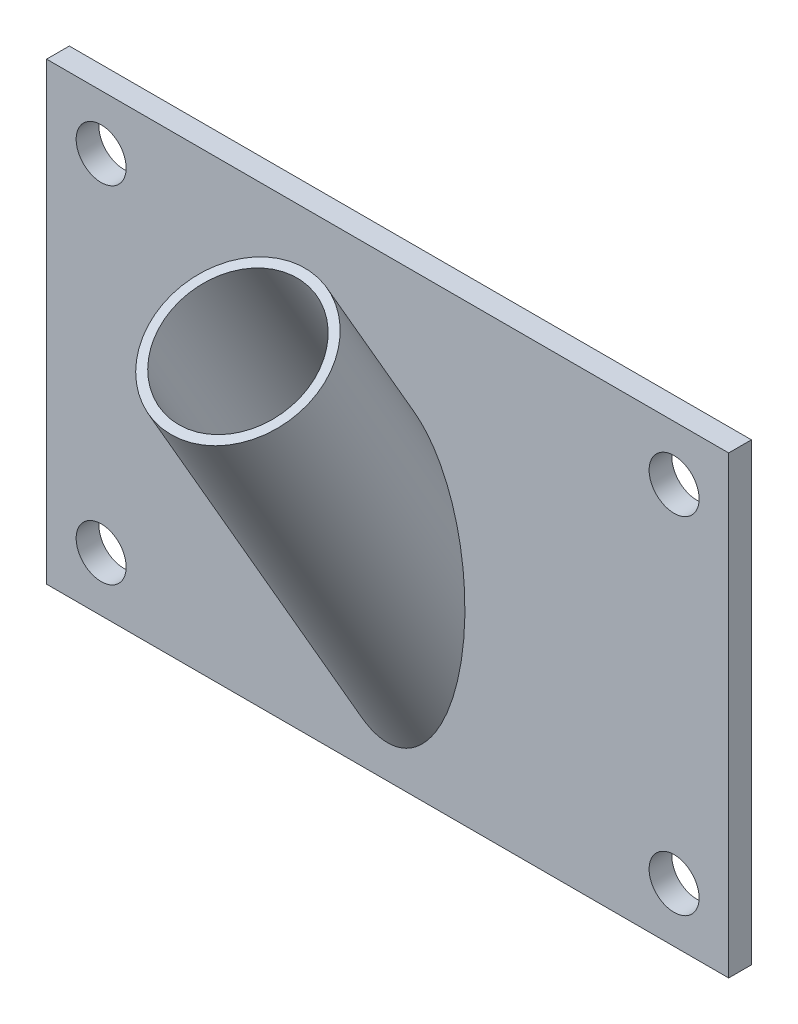
ISO-10303-21;
HEADER;
FILE_DESCRIPTION(('STEP AP214'),'2;1');
FILE_NAME('part.step','',(''),(''),'','','');
FILE_SCHEMA(('AUTOMOTIVE_DESIGN { 1 0 10303 214 1 1 1 1 }'));
ENDSEC;
DATA;
#1=APPLICATION_CONTEXT('core data for automotive mechanical design processes');
#2=APPLICATION_PROTOCOL_DEFINITION('international standard','automotive_design',2000,#1);
#3=PRODUCT_CONTEXT('',#1,'mechanical');
#4=PRODUCT('Part','Part','',(#3));
#5=PRODUCT_RELATED_PRODUCT_CATEGORY('part','',(#4));
#6=PRODUCT_DEFINITION_FORMATION('','',#4);
#7=PRODUCT_DEFINITION_CONTEXT('part definition',#1,'design');
#8=PRODUCT_DEFINITION('design','',#6,#7);
#9=PRODUCT_DEFINITION_SHAPE('','',#8);
#10=(LENGTH_UNIT() NAMED_UNIT(*) SI_UNIT(.MILLI.,.METRE.));
#11=(NAMED_UNIT(*) PLANE_ANGLE_UNIT() SI_UNIT($,.RADIAN.));
#12=(NAMED_UNIT(*) SI_UNIT($,.STERADIAN.) SOLID_ANGLE_UNIT());
#13=UNCERTAINTY_MEASURE_WITH_UNIT(LENGTH_MEASURE(1.E-05),#10,'distance_accuracy_value','');
#14=(GEOMETRIC_REPRESENTATION_CONTEXT(3) GLOBAL_UNCERTAINTY_ASSIGNED_CONTEXT((#13)) GLOBAL_UNIT_ASSIGNED_CONTEXT((#10,
#11,#12)) REPRESENTATION_CONTEXT('',''));
#15=CARTESIAN_POINT('',(0.,0.,0.));
#16=DIRECTION('',(0.,0.,1.));
#17=DIRECTION('',(1.,0.,0.));
#18=AXIS2_PLACEMENT_3D('',#15,#16,#17);
#19=CARTESIAN_POINT('',(-75.,49.9999999999999,5.));
#20=DIRECTION('',(1.,0.,0.));
#21=DIRECTION('',(0.,0.,-1.));
#22=AXIS2_PLACEMENT_3D('',#19,#20,#21);
#23=PLANE('',#22);
#24=DIRECTION('',(0.,-1.,0.));
#25=VECTOR('',#24,1.);
#26=CARTESIAN_POINT('',(-75.,49.9999999999999,0.));
#27=LINE('',#26,#25);
#28=CARTESIAN_POINT('',(-75.,49.9999999999999,0.));
#29=VERTEX_POINT('',#28);
#30=CARTESIAN_POINT('',(-75.,-50.0000000000001,0.));
#31=VERTEX_POINT('',#30);
#32=EDGE_CURVE('E109',#29,#31,#27,.T.);
#33=ORIENTED_EDGE('',*,*,#32,.T.);
#34=DIRECTION('',(0.,0.,-1.));
#35=VECTOR('',#34,1.);
#36=CARTESIAN_POINT('',(-75.,-50.0000000000001,5.));
#37=LINE('',#36,#35);
#38=CARTESIAN_POINT('',(-75.,-50.0000000000001,5.));
#39=VERTEX_POINT('',#38);
#40=EDGE_CURVE('E47',#39,#31,#37,.T.);
#41=ORIENTED_EDGE('',*,*,#40,.F.);
#42=DIRECTION('',(0.,-1.,0.));
#43=VECTOR('',#42,1.);
#44=CARTESIAN_POINT('',(-75.,49.9999999999999,5.));
#45=LINE('',#44,#43);
#46=CARTESIAN_POINT('',(-75.,49.9999999999999,5.));
#47=VERTEX_POINT('',#46);
#48=EDGE_CURVE('E91',#47,#39,#45,.T.);
#49=ORIENTED_EDGE('',*,*,#48,.F.);
#50=DIRECTION('',(0.,0.,-1.));
#51=VECTOR('',#50,1.);
#52=CARTESIAN_POINT('',(-75.,49.9999999999999,5.));
#53=LINE('',#52,#51);
#54=EDGE_CURVE('E105',#47,#29,#53,.T.);
#55=ORIENTED_EDGE('',*,*,#54,.T.);
#56=EDGE_LOOP('',(#33,#41,#49,#55));
#57=FACE_BOUND('',#56,.T.);
#58=ADVANCED_FACE('F38',(#57),#23,.F.);
#59=CARTESIAN_POINT('',(-75.,-50.0000000000001,5.));
#60=DIRECTION('',(0.,1.,0.));
#61=DIRECTION('',(0.,0.,1.));
#62=AXIS2_PLACEMENT_3D('',#59,#60,#61);
#63=PLANE('',#62);
#64=DIRECTION('',(1.,0.,0.));
#65=VECTOR('',#64,1.);
#66=CARTESIAN_POINT('',(-75.,-50.0000000000001,0.));
#67=LINE('',#66,#65);
#68=CARTESIAN_POINT('',(75.,-50.0000000000001,0.));
#69=VERTEX_POINT('',#68);
#70=EDGE_CURVE('E97',#31,#69,#67,.T.);
#71=ORIENTED_EDGE('',*,*,#70,.T.);
#72=DIRECTION('',(0.,0.,-1.));
#73=VECTOR('',#72,1.);
#74=CARTESIAN_POINT('',(75.,-50.0000000000001,5.));
#75=LINE('',#74,#73);
#76=CARTESIAN_POINT('',(75.,-50.0000000000001,5.));
#77=VERTEX_POINT('',#76);
#78=EDGE_CURVE('E95',#77,#69,#75,.T.);
#79=ORIENTED_EDGE('',*,*,#78,.F.);
#80=DIRECTION('',(1.,0.,0.));
#81=VECTOR('',#80,1.);
#82=CARTESIAN_POINT('',(-75.,-50.0000000000001,5.));
#83=LINE('',#82,#81);
#84=EDGE_CURVE('E86',#39,#77,#83,.T.);
#85=ORIENTED_EDGE('',*,*,#84,.F.);
#86=ORIENTED_EDGE('',*,*,#40,.T.);
#87=EDGE_LOOP('',(#71,#79,#85,#86));
#88=FACE_BOUND('',#87,.T.);
#89=ADVANCED_FACE('F96',(#88),#63,.F.);
#90=CARTESIAN_POINT('',(75.,49.9999999999999,5.));
#91=DIRECTION('',(-1.,0.,0.));
#92=DIRECTION('',(0.,0.,1.));
#93=AXIS2_PLACEMENT_3D('',#90,#91,#92);
#94=PLANE('',#93);
#95=DIRECTION('',(0.,1.,0.));
#96=VECTOR('',#95,1.);
#97=CARTESIAN_POINT('',(75.,49.9999999999999,0.));
#98=LINE('',#97,#96);
#99=CARTESIAN_POINT('',(75.,49.9999999999999,0.));
#100=VERTEX_POINT('',#99);
#101=EDGE_CURVE('E72',#69,#100,#98,.T.);
#102=ORIENTED_EDGE('',*,*,#101,.T.);
#103=DIRECTION('',(0.,0.,-1.));
#104=VECTOR('',#103,1.);
#105=CARTESIAN_POINT('',(75.,49.9999999999999,5.));
#106=LINE('',#105,#104);
#107=CARTESIAN_POINT('',(75.,49.9999999999999,5.));
#108=VERTEX_POINT('',#107);
#109=EDGE_CURVE('E99',#108,#100,#106,.T.);
#110=ORIENTED_EDGE('',*,*,#109,.F.);
#111=DIRECTION('',(0.,1.,0.));
#112=VECTOR('',#111,1.);
#113=CARTESIAN_POINT('',(75.,49.9999999999999,5.));
#114=LINE('',#113,#112);
#115=EDGE_CURVE('E89',#77,#108,#114,.T.);
#116=ORIENTED_EDGE('',*,*,#115,.F.);
#117=ORIENTED_EDGE('',*,*,#78,.T.);
#118=EDGE_LOOP('',(#102,#110,#116,#117));
#119=FACE_BOUND('',#118,.T.);
#120=ADVANCED_FACE('F101',(#119),#94,.F.);
#121=CARTESIAN_POINT('',(-75.,49.9999999999999,5.));
#122=DIRECTION('',(0.,-1.,0.));
#123=DIRECTION('',(0.,0.,-1.));
#124=AXIS2_PLACEMENT_3D('',#121,#122,#123);
#125=PLANE('',#124);
#126=DIRECTION('',(-1.,0.,0.));
#127=VECTOR('',#126,1.);
#128=CARTESIAN_POINT('',(-75.,49.9999999999999,0.));
#129=LINE('',#128,#127);
#130=EDGE_CURVE('E78',#100,#29,#129,.T.);
#131=ORIENTED_EDGE('',*,*,#130,.T.);
#132=ORIENTED_EDGE('',*,*,#54,.F.);
#133=DIRECTION('',(-1.,0.,0.));
#134=VECTOR('',#133,1.);
#135=CARTESIAN_POINT('',(-75.,49.9999999999999,5.));
#136=LINE('',#135,#134);
#137=EDGE_CURVE('E55',#108,#47,#136,.T.);
#138=ORIENTED_EDGE('',*,*,#137,.F.);
#139=ORIENTED_EDGE('',*,*,#109,.T.);
#140=EDGE_LOOP('',(#131,#132,#138,#139));
#141=FACE_BOUND('',#140,.T.);
#142=ADVANCED_FACE('F139',(#141),#125,.F.);
#143=CARTESIAN_POINT('',(0.,0.,5.));
#144=DIRECTION('',(0.,0.,1.));
#145=DIRECTION('',(1.,0.,0.));
#146=AXIS2_PLACEMENT_3D('',#143,#144,#145);
#147=PLANE('',#146);
#148=CARTESIAN_POINT('',(0.,-8.70589740370179,5.));
#149=DIRECTION('',(0.,0.,1.));
#150=DIRECTION('',(0.,1.,0.));
#151=AXIS2_PLACEMENT_3D('',#148,#149,#150);
#152=ELLIPSE('',#151,33.9999999999999,17.);
#153=CARTESIAN_POINT('',(0.,25.2941025962981,5.));
#154=VERTEX_POINT('',#153);
#155=EDGE_CURVE('E11',#154,#154,#152,.T.);
#156=ORIENTED_EDGE('',*,*,#155,.F.);
#157=EDGE_LOOP('',(#156));
#158=FACE_BOUND('',#157,.T.);
#159=CARTESIAN_POINT('',(63.,-37.9999999999999,5.));
#160=DIRECTION('',(0.,0.,1.));
#161=DIRECTION('',(1.,0.,0.));
#162=AXIS2_PLACEMENT_3D('',#159,#160,#161);
#163=CIRCLE('',#162,5.49999999999999);
#164=CARTESIAN_POINT('',(68.5,-37.9999999999999,5.));
#165=VERTEX_POINT('',#164);
#166=EDGE_CURVE('E281',#165,#165,#163,.T.);
#167=ORIENTED_EDGE('',*,*,#166,.F.);
#168=EDGE_LOOP('',(#167));
#169=FACE_BOUND('',#168,.T.);
#170=CARTESIAN_POINT('',(-63.,-37.9999999999999,5.));
#171=DIRECTION('',(0.,0.,1.));
#172=DIRECTION('',(1.,0.,0.));
#173=AXIS2_PLACEMENT_3D('',#170,#171,#172);
#174=CIRCLE('',#173,5.5);
#175=CARTESIAN_POINT('',(-57.5,-37.9999999999999,5.));
#176=VERTEX_POINT('',#175);
#177=EDGE_CURVE('E260',#176,#176,#174,.T.);
#178=ORIENTED_EDGE('',*,*,#177,.F.);
#179=EDGE_LOOP('',(#178));
#180=FACE_BOUND('',#179,.T.);
#181=CARTESIAN_POINT('',(63.,37.9999999999999,5.));
#182=DIRECTION('',(0.,0.,1.));
#183=DIRECTION('',(1.,0.,0.));
#184=AXIS2_PLACEMENT_3D('',#181,#182,#183);
#185=CIRCLE('',#184,5.49999999999999);
#186=CARTESIAN_POINT('',(68.5,37.9999999999999,5.));
#187=VERTEX_POINT('',#186);
#188=EDGE_CURVE('E250',#187,#187,#185,.T.);
#189=ORIENTED_EDGE('',*,*,#188,.F.);
#190=EDGE_LOOP('',(#189));
#191=FACE_BOUND('',#190,.T.);
#192=CARTESIAN_POINT('',(-63.,37.9999999999999,5.));
#193=DIRECTION('',(0.,0.,1.));
#194=DIRECTION('',(1.,0.,0.));
#195=AXIS2_PLACEMENT_3D('',#192,#193,#194);
#196=CIRCLE('',#195,5.5);
#197=CARTESIAN_POINT('',(-57.5,37.9999999999999,5.));
#198=VERTEX_POINT('',#197);
#199=EDGE_CURVE('E257',#198,#198,#196,.T.);
#200=ORIENTED_EDGE('',*,*,#199,.F.);
#201=EDGE_LOOP('',(#200));
#202=FACE_BOUND('',#201,.T.);
#203=ORIENTED_EDGE('',*,*,#48,.T.);
#204=ORIENTED_EDGE('',*,*,#84,.T.);
#205=ORIENTED_EDGE('',*,*,#115,.T.);
#206=ORIENTED_EDGE('',*,*,#137,.T.);
#207=EDGE_LOOP('',(#203,#204,#205,#206));
#208=FACE_BOUND('',#207,.T.);
#209=ADVANCED_FACE('F87',(#158,#169,#180,#191,#202,#208),#147,.T.);
#210=CARTESIAN_POINT('',(0.,0.,0.));
#211=DIRECTION('',(0.,0.,1.));
#212=DIRECTION('',(1.,0.,0.));
#213=AXIS2_PLACEMENT_3D('',#210,#211,#212);
#214=PLANE('',#213);
#215=CARTESIAN_POINT('',(63.,-37.9999999999999,0.));
#216=DIRECTION('',(0.,0.,1.));
#217=DIRECTION('',(1.,0.,0.));
#218=AXIS2_PLACEMENT_3D('',#215,#216,#217);
#219=CIRCLE('',#218,5.50000000000001);
#220=CARTESIAN_POINT('',(68.5,-37.9999999999999,0.));
#221=VERTEX_POINT('',#220);
#222=EDGE_CURVE('E278',#221,#221,#219,.T.);
#223=ORIENTED_EDGE('',*,*,#222,.T.);
#224=EDGE_LOOP('',(#223));
#225=FACE_BOUND('',#224,.T.);
#226=CARTESIAN_POINT('',(-63.,-37.9999999999999,0.));
#227=DIRECTION('',(0.,0.,1.));
#228=DIRECTION('',(1.,0.,0.));
#229=AXIS2_PLACEMENT_3D('',#226,#227,#228);
#230=CIRCLE('',#229,5.5);
#231=CARTESIAN_POINT('',(-57.5,-37.9999999999999,0.));
#232=VERTEX_POINT('',#231);
#233=EDGE_CURVE('E253',#232,#232,#230,.T.);
#234=ORIENTED_EDGE('',*,*,#233,.T.);
#235=EDGE_LOOP('',(#234));
#236=FACE_BOUND('',#235,.T.);
#237=CARTESIAN_POINT('',(63.,37.9999999999999,0.));
#238=DIRECTION('',(0.,0.,1.));
#239=DIRECTION('',(1.,0.,0.));
#240=AXIS2_PLACEMENT_3D('',#237,#238,#239);
#241=CIRCLE('',#240,5.50000000000001);
#242=CARTESIAN_POINT('',(68.5,37.9999999999999,0.));
#243=VERTEX_POINT('',#242);
#244=EDGE_CURVE('E247',#243,#243,#241,.T.);
#245=ORIENTED_EDGE('',*,*,#244,.T.);
#246=EDGE_LOOP('',(#245));
#247=FACE_BOUND('',#246,.T.);
#248=CARTESIAN_POINT('',(-63.,37.9999999999999,0.));
#249=DIRECTION('',(0.,0.,1.));
#250=DIRECTION('',(1.,0.,0.));
#251=AXIS2_PLACEMENT_3D('',#248,#249,#250);
#252=CIRCLE('',#251,5.5);
#253=CARTESIAN_POINT('',(-57.5,37.9999999999999,0.));
#254=VERTEX_POINT('',#253);
#255=EDGE_CURVE('E113',#254,#254,#252,.T.);
#256=ORIENTED_EDGE('',*,*,#255,.T.);
#257=EDGE_LOOP('',(#256));
#258=FACE_BOUND('',#257,.T.);
#259=ORIENTED_EDGE('',*,*,#32,.F.);
#260=ORIENTED_EDGE('',*,*,#130,.F.);
#261=ORIENTED_EDGE('',*,*,#101,.F.);
#262=ORIENTED_EDGE('',*,*,#70,.F.);
#263=EDGE_LOOP('',(#259,#260,#261,#262));
#264=FACE_BOUND('',#263,.T.);
#265=ADVANCED_FACE('F127',(#225,#236,#247,#258,#264),#214,.F.);
#266=CARTESIAN_POINT('',(-63.,37.9999999999999,5.));
#267=DIRECTION('',(0.,0.,1.));
#268=DIRECTION('',(1.,0.,0.));
#269=AXIS2_PLACEMENT_3D('',#266,#267,#268);
#270=CYLINDRICAL_SURFACE('',#269,5.5);
#271=ORIENTED_EDGE('',*,*,#255,.F.);
#272=EDGE_LOOP('',(#271));
#273=FACE_BOUND('',#272,.T.);
#274=ORIENTED_EDGE('',*,*,#199,.T.);
#275=EDGE_LOOP('',(#274));
#276=FACE_BOUND('',#275,.T.);
#277=ADVANCED_FACE('F129',(#273,#276),#270,.F.);
#278=CARTESIAN_POINT('',(63.,37.9999999999999,5.));
#279=DIRECTION('',(0.,0.,1.));
#280=DIRECTION('',(1.,0.,0.));
#281=AXIS2_PLACEMENT_3D('',#278,#279,#280);
#282=CYLINDRICAL_SURFACE('',#281,5.5);
#283=ORIENTED_EDGE('',*,*,#244,.F.);
#284=EDGE_LOOP('',(#283));
#285=FACE_BOUND('',#284,.T.);
#286=ORIENTED_EDGE('',*,*,#188,.T.);
#287=EDGE_LOOP('',(#286));
#288=FACE_BOUND('',#287,.T.);
#289=ADVANCED_FACE('F136',(#285,#288),#282,.F.);
#290=CARTESIAN_POINT('',(-63.,-37.9999999999999,5.));
#291=DIRECTION('',(0.,0.,1.));
#292=DIRECTION('',(1.,0.,0.));
#293=AXIS2_PLACEMENT_3D('',#290,#291,#292);
#294=CYLINDRICAL_SURFACE('',#293,5.5);
#295=ORIENTED_EDGE('',*,*,#233,.F.);
#296=EDGE_LOOP('',(#295));
#297=FACE_BOUND('',#296,.T.);
#298=ORIENTED_EDGE('',*,*,#177,.T.);
#299=EDGE_LOOP('',(#298));
#300=FACE_BOUND('',#299,.T.);
#301=ADVANCED_FACE('F216',(#297,#300),#294,.F.);
#302=CARTESIAN_POINT('',(63.,-37.9999999999999,5.));
#303=DIRECTION('',(0.,0.,1.));
#304=DIRECTION('',(1.,0.,0.));
#305=AXIS2_PLACEMENT_3D('',#302,#303,#304);
#306=CYLINDRICAL_SURFACE('',#305,5.5);
#307=ORIENTED_EDGE('',*,*,#222,.F.);
#308=EDGE_LOOP('',(#307));
#309=FACE_BOUND('',#308,.T.);
#310=ORIENTED_EDGE('',*,*,#166,.T.);
#311=EDGE_LOOP('',(#310));
#312=FACE_BOUND('',#311,.T.);
#313=ADVANCED_FACE('F171',(#309,#312),#306,.F.);
#314=CARTESIAN_POINT('',(0.,-71.1678858446727,-31.062445840514));
#315=DIRECTION('',(0.,0.866025403784438,0.500000000000001));
#316=DIRECTION('',(0.,-0.500000000000001,0.866025403784438));
#317=AXIS2_PLACEMENT_3D('',#314,#315,#316);
#318=CYLINDRICAL_SURFACE('',#317,17.);
#319=ORIENTED_EDGE('',*,*,#155,.T.);
#320=EDGE_LOOP('',(#319));
#321=FACE_BOUND('',#320,.T.);
#322=CARTESIAN_POINT('',(0.,48.313906705841,37.9203992517843));
#323=DIRECTION('',(0.,0.866025403784438,0.500000000000001));
#324=DIRECTION('',(0.,-0.500000000000001,0.866025403784438));
#325=AXIS2_PLACEMENT_3D('',#322,#323,#324);
#326=CIRCLE('',#325,17.);
#327=CARTESIAN_POINT('',(0.,39.813906705841,52.6428311161198));
#328=VERTEX_POINT('',#327);
#329=EDGE_CURVE('E289',#328,#328,#326,.T.);
#330=ORIENTED_EDGE('',*,*,#329,.F.);
#331=EDGE_LOOP('',(#330));
#332=FACE_BOUND('',#331,.T.);
#333=ADVANCED_FACE('F176',(#321,#332),#318,.T.);
#334=CARTESIAN_POINT('',(0.,-71.1678858446727,-31.062445840514));
#335=DIRECTION('',(0.,0.866025403784438,0.500000000000001));
#336=DIRECTION('',(0.,-0.500000000000001,0.866025403784438));
#337=AXIS2_PLACEMENT_3D('',#334,#335,#336);
#338=CYLINDRICAL_SURFACE('',#337,15.);
#339=CARTESIAN_POINT('',(0.,-8.70589740370179,5.));
#340=DIRECTION('',(0.,0.,1.));
#341=DIRECTION('',(0.,1.,0.));
#342=AXIS2_PLACEMENT_3D('',#339,#340,#341);
#343=ELLIPSE('',#342,29.9999999999999,15.);
#344=CARTESIAN_POINT('',(0.,21.2941025962981,5.));
#345=VERTEX_POINT('',#344);
#346=EDGE_CURVE('E285',#345,#345,#343,.F.);
#347=ORIENTED_EDGE('',*,*,#346,.T.);
#348=EDGE_LOOP('',(#347));
#349=FACE_BOUND('',#348,.T.);
#350=CARTESIAN_POINT('',(0.,48.313906705841,37.9203992517843));
#351=DIRECTION('',(0.,0.866025403784438,0.500000000000001));
#352=DIRECTION('',(0.,-0.500000000000001,0.866025403784438));
#353=AXIS2_PLACEMENT_3D('',#350,#351,#352);
#354=CIRCLE('',#353,15.);
#355=CARTESIAN_POINT('',(0.,40.813906705841,50.9107803085509));
#356=VERTEX_POINT('',#355);
#357=EDGE_CURVE('E293',#356,#356,#354,.T.);
#358=ORIENTED_EDGE('',*,*,#357,.T.);
#359=EDGE_LOOP('',(#358));
#360=FACE_BOUND('',#359,.T.);
#361=ADVANCED_FACE('F181',(#349,#360),#338,.F.);
#362=CARTESIAN_POINT('',(0.,48.313906705841,37.9203992517843));
#363=DIRECTION('',(0.,0.866025403784438,0.500000000000001));
#364=DIRECTION('',(0.,-0.500000000000001,0.866025403784438));
#365=AXIS2_PLACEMENT_3D('',#362,#363,#364);
#366=PLANE('',#365);
#367=ORIENTED_EDGE('',*,*,#329,.T.);
#368=EDGE_LOOP('',(#367));
#369=FACE_BOUND('',#368,.T.);
#370=ORIENTED_EDGE('',*,*,#357,.F.);
#371=EDGE_LOOP('',(#370));
#372=FACE_BOUND('',#371,.T.);
#373=ADVANCED_FACE('F192',(#369,#372),#366,.T.);
#374=ORIENTED_EDGE('',*,*,#346,.F.);
#375=EDGE_LOOP('',(#374));
#376=FACE_BOUND('',#375,.T.);
#377=ADVANCED_FACE('F142',(#376),#147,.T.);
#378=CLOSED_SHELL('',(#58,#89,#120,#142,#209,#265,#277,#289,#301,#313,#333,#361,#373,#377));
#379=MANIFOLD_SOLID_BREP('B2',#378);
#380=ADVANCED_BREP_SHAPE_REPRESENTATION('',(#18,#379),#14);
#381=SHAPE_DEFINITION_REPRESENTATION(#9,#380);
ENDSEC;
END-ISO-10303-21;
